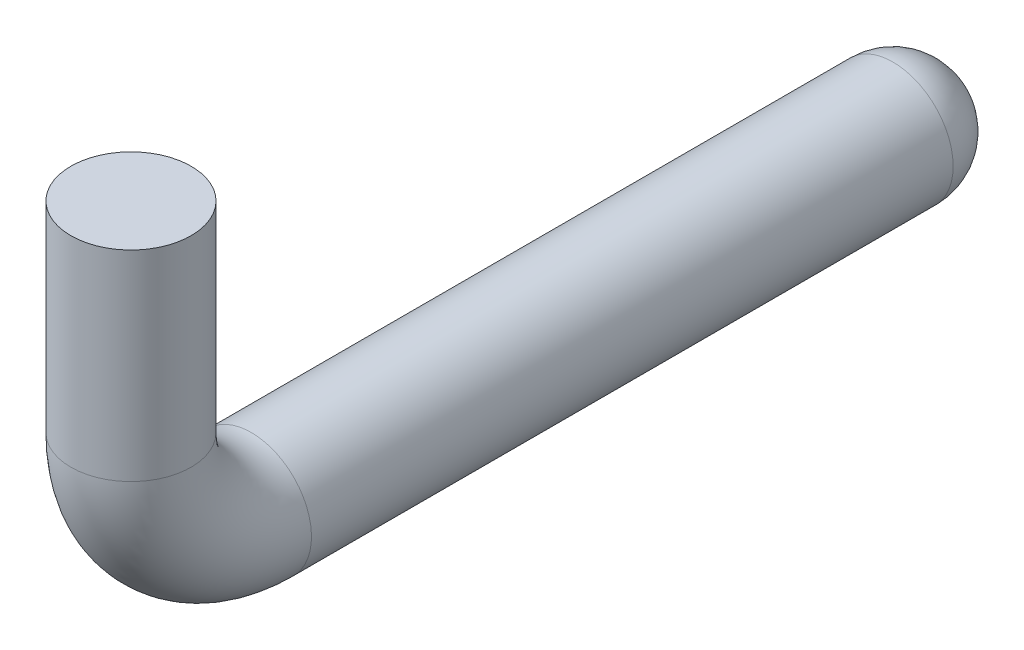
ISO-10303-21;
HEADER;
FILE_DESCRIPTION(('STEP AP214'),'2;1');
FILE_NAME('part.step','',(''),(''),'','','');
FILE_SCHEMA(('AUTOMOTIVE_DESIGN { 1 0 10303 214 1 1 1 1 }'));
ENDSEC;
DATA;
#1=APPLICATION_CONTEXT('core data for automotive mechanical design processes');
#2=APPLICATION_PROTOCOL_DEFINITION('international standard','automotive_design',2000,#1);
#3=PRODUCT_CONTEXT('',#1,'mechanical');
#4=PRODUCT('Part','Part','',(#3));
#5=PRODUCT_RELATED_PRODUCT_CATEGORY('part','',(#4));
#6=PRODUCT_DEFINITION_FORMATION('','',#4);
#7=PRODUCT_DEFINITION_CONTEXT('part definition',#1,'design');
#8=PRODUCT_DEFINITION('design','',#6,#7);
#9=PRODUCT_DEFINITION_SHAPE('','',#8);
#10=(LENGTH_UNIT() NAMED_UNIT(*) SI_UNIT(.MILLI.,.METRE.));
#11=(NAMED_UNIT(*) PLANE_ANGLE_UNIT() SI_UNIT($,.RADIAN.));
#12=(NAMED_UNIT(*) SI_UNIT($,.STERADIAN.) SOLID_ANGLE_UNIT());
#13=UNCERTAINTY_MEASURE_WITH_UNIT(LENGTH_MEASURE(1.E-05),#10,'distance_accuracy_value','');
#14=(GEOMETRIC_REPRESENTATION_CONTEXT(3) GLOBAL_UNCERTAINTY_ASSIGNED_CONTEXT((#13)) GLOBAL_UNIT_ASSIGNED_CONTEXT((#10,
#11,#12)) REPRESENTATION_CONTEXT('',''));
#15=CARTESIAN_POINT('',(0.,0.,0.));
#16=DIRECTION('',(0.,0.,1.));
#17=DIRECTION('',(1.,0.,0.));
#18=AXIS2_PLACEMENT_3D('',#15,#16,#17);
#19=CARTESIAN_POINT('',(0.,-0.4,-0.15));
#20=DIRECTION('',(0.,0.,-1.));
#21=DIRECTION('',(0.,1.,0.));
#22=AXIS2_PLACEMENT_3D('',#19,#20,#21);
#23=CYLINDRICAL_SURFACE('',#22,0.075);
#24=CARTESIAN_POINT('',(0.,-0.4,-0.15));
#25=DIRECTION('',(0.,0.,1.));
#26=DIRECTION('',(0.,-1.,0.));
#27=AXIS2_PLACEMENT_3D('',#24,#25,#26);
#28=CIRCLE('',#27,0.075);
#29=CARTESIAN_POINT('',(0.,-0.475,-0.15));
#30=VERTEX_POINT('',#29);
#31=EDGE_CURVE('E39',#30,#30,#28,.T.);
#32=ORIENTED_EDGE('',*,*,#31,.F.);
#33=EDGE_LOOP('',(#32));
#34=FACE_BOUND('',#33,.T.);
#35=CARTESIAN_POINT('',(0.,-0.4,-0.95));
#36=DIRECTION('',(0.,0.,1.));
#37=DIRECTION('',(0.,-1.,0.));
#38=AXIS2_PLACEMENT_3D('',#35,#36,#37);
#39=CIRCLE('',#38,0.075);
#40=CARTESIAN_POINT('',(0.,-0.475,-0.95));
#41=VERTEX_POINT('',#40);
#42=EDGE_CURVE('E10',#41,#41,#39,.T.);
#43=ORIENTED_EDGE('',*,*,#42,.T.);
#44=EDGE_LOOP('',(#43));
#45=FACE_BOUND('',#44,.T.);
#46=ADVANCED_FACE('F32',(#34,#45),#23,.T.);
#47=CARTESIAN_POINT('',(0.,-0.25,-0.15));
#48=DIRECTION('',(1.,0.,0.));
#49=DIRECTION('',(0.,0.,-1.));
#50=AXIS2_PLACEMENT_3D('',#47,#48,#49);
#51=TOROIDAL_SURFACE('',#50,0.15,0.075);
#52=CARTESIAN_POINT('',(0.,-0.25,0.));
#53=DIRECTION('',(0.,1.,0.));
#54=DIRECTION('',(0.,0.,1.));
#55=AXIS2_PLACEMENT_3D('',#52,#53,#54);
#56=CIRCLE('',#55,0.075);
#57=CARTESIAN_POINT('',(0.,-0.25,0.075));
#58=VERTEX_POINT('',#57);
#59=EDGE_CURVE('E43',#58,#58,#56,.T.);
#60=CARTESIAN_POINT('',(0.,-0.25,-0.15));
#61=DIRECTION('',(1.,0.,0.));
#62=DIRECTION('',(0.,0.,-1.));
#63=AXIS2_PLACEMENT_3D('',#60,#61,#62);
#64=CIRCLE('',#63,0.225);
#65=EDGE_CURVE('',#58,#30,#64,.T.);
#66=ORIENTED_EDGE('',*,*,#59,.F.);
#67=ORIENTED_EDGE('',*,*,#31,.T.);
#68=ORIENTED_EDGE('',*,*,#65,.T.);
#69=ORIENTED_EDGE('',*,*,#65,.F.);
#70=EDGE_LOOP('',(#66,#68,#67,#69));
#71=FACE_BOUND('',#70,.T.);
#72=ADVANCED_FACE('F57',(#71),#51,.T.);
#73=CARTESIAN_POINT('',(0.,-0.25,0.));
#74=DIRECTION('',(0.,1.,0.));
#75=DIRECTION('',(0.,0.,1.));
#76=AXIS2_PLACEMENT_3D('',#73,#74,#75);
#77=CYLINDRICAL_SURFACE('',#76,0.075);
#78=ORIENTED_EDGE('',*,*,#59,.T.);
#79=EDGE_LOOP('',(#78));
#80=FACE_BOUND('',#79,.T.);
#81=CARTESIAN_POINT('',(0.,0.,0.));
#82=DIRECTION('',(0.,1.,0.));
#83=DIRECTION('',(0.,0.,1.));
#84=AXIS2_PLACEMENT_3D('',#81,#82,#83);
#85=CIRCLE('',#84,0.075);
#86=CARTESIAN_POINT('',(0.,0.,0.075));
#87=VERTEX_POINT('',#86);
#88=EDGE_CURVE('E47',#87,#87,#85,.T.);
#89=ORIENTED_EDGE('',*,*,#88,.F.);
#90=EDGE_LOOP('',(#89));
#91=FACE_BOUND('',#90,.T.);
#92=ADVANCED_FACE('F55',(#80,#91),#77,.T.);
#93=CARTESIAN_POINT('',(0.,-0.4,-0.95));
#94=DIRECTION('',(0.,0.,1.));
#95=DIRECTION('',(1.,0.,0.));
#96=AXIS2_PLACEMENT_3D('',#93,#94,#95);
#97=SPHERICAL_SURFACE('',#96,0.075);
#98=ORIENTED_EDGE('',*,*,#42,.F.);
#99=EDGE_LOOP('',(#98));
#100=FACE_BOUND('',#99,.T.);
#101=ADVANCED_FACE('F34',(#100),#97,.T.);
#102=CARTESIAN_POINT('',(0.,0.,0.));
#103=DIRECTION('',(0.,1.,0.));
#104=DIRECTION('',(0.,0.,1.));
#105=AXIS2_PLACEMENT_3D('',#102,#103,#104);
#106=PLANE('',#105);
#107=ORIENTED_EDGE('',*,*,#88,.T.);
#108=EDGE_LOOP('',(#107));
#109=FACE_BOUND('',#108,.T.);
#110=ADVANCED_FACE('F53',(#109),#106,.T.);
#111=CLOSED_SHELL('',(#46,#72,#92,#101,#110));
#112=MANIFOLD_SOLID_BREP('B2',#111);
#113=ADVANCED_BREP_SHAPE_REPRESENTATION('',(#18,#112),#14);
#114=SHAPE_DEFINITION_REPRESENTATION(#9,#113);
ENDSEC;
END-ISO-10303-21;
